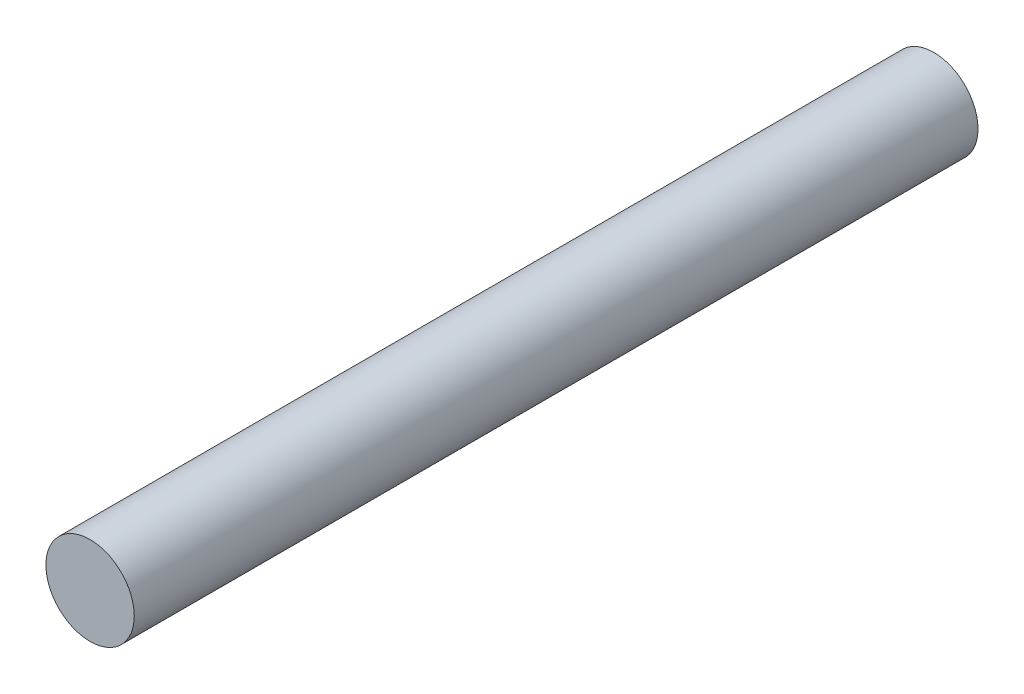
ISO-10303-21;
HEADER;
FILE_DESCRIPTION(('STEP AP214'),'2;1');
FILE_NAME('part.step','',(''),(''),'','','');
FILE_SCHEMA(('AUTOMOTIVE_DESIGN { 1 0 10303 214 1 1 1 1 }'));
ENDSEC;
DATA;
#1=APPLICATION_CONTEXT('core data for automotive mechanical design processes');
#2=APPLICATION_PROTOCOL_DEFINITION('international standard','automotive_design',2000,#1);
#3=PRODUCT_CONTEXT('',#1,'mechanical');
#4=PRODUCT('Part','Part','',(#3));
#5=PRODUCT_RELATED_PRODUCT_CATEGORY('part','',(#4));
#6=PRODUCT_DEFINITION_FORMATION('','',#4);
#7=PRODUCT_DEFINITION_CONTEXT('part definition',#1,'design');
#8=PRODUCT_DEFINITION('design','',#6,#7);
#9=PRODUCT_DEFINITION_SHAPE('','',#8);
#10=(LENGTH_UNIT() NAMED_UNIT(*) SI_UNIT(.MILLI.,.METRE.));
#11=(NAMED_UNIT(*) PLANE_ANGLE_UNIT() SI_UNIT($,.RADIAN.));
#12=(NAMED_UNIT(*) SI_UNIT($,.STERADIAN.) SOLID_ANGLE_UNIT());
#13=UNCERTAINTY_MEASURE_WITH_UNIT(LENGTH_MEASURE(1.E-05),#10,'distance_accuracy_value','');
#14=(GEOMETRIC_REPRESENTATION_CONTEXT(3) GLOBAL_UNCERTAINTY_ASSIGNED_CONTEXT((#13)) GLOBAL_UNIT_ASSIGNED_CONTEXT((#10,
#11,#12)) REPRESENTATION_CONTEXT('',''));
#15=CARTESIAN_POINT('',(0.,0.,0.));
#16=DIRECTION('',(0.,0.,1.));
#17=DIRECTION('',(1.,0.,0.));
#18=AXIS2_PLACEMENT_3D('',#15,#16,#17);
#19=CARTESIAN_POINT('',(0.,0.,24.257));
#20=DIRECTION('',(0.,0.,-1.));
#21=DIRECTION('',(-1.,0.,0.));
#22=AXIS2_PLACEMENT_3D('',#19,#20,#21);
#23=CYLINDRICAL_SURFACE('',#22,1.27);
#24=CARTESIAN_POINT('',(0.,0.,24.257));
#25=DIRECTION('',(0.,0.,1.));
#26=DIRECTION('',(1.,0.,0.));
#27=AXIS2_PLACEMENT_3D('',#24,#25,#26);
#28=CIRCLE('',#27,1.27);
#29=CARTESIAN_POINT('',(1.27,0.,24.257));
#30=VERTEX_POINT('',#29);
#31=EDGE_CURVE('E10',#30,#30,#28,.T.);
#32=ORIENTED_EDGE('',*,*,#31,.F.);
#33=EDGE_LOOP('',(#32));
#34=FACE_BOUND('',#33,.T.);
#35=CARTESIAN_POINT('',(0.,0.,0.));
#36=DIRECTION('',(0.,0.,1.));
#37=DIRECTION('',(1.,0.,0.));
#38=AXIS2_PLACEMENT_3D('',#35,#36,#37);
#39=CIRCLE('',#38,1.27);
#40=CARTESIAN_POINT('',(1.27,0.,0.));
#41=VERTEX_POINT('',#40);
#42=EDGE_CURVE('E36',#41,#41,#39,.T.);
#43=ORIENTED_EDGE('',*,*,#42,.T.);
#44=EDGE_LOOP('',(#43));
#45=FACE_BOUND('',#44,.T.);
#46=ADVANCED_FACE('F33',(#34,#45),#23,.T.);
#47=CARTESIAN_POINT('',(0.,0.,24.257));
#48=DIRECTION('',(0.,0.,1.));
#49=DIRECTION('',(1.,0.,0.));
#50=AXIS2_PLACEMENT_3D('',#47,#48,#49);
#51=PLANE('',#50);
#52=ORIENTED_EDGE('',*,*,#31,.T.);
#53=EDGE_LOOP('',(#52));
#54=FACE_BOUND('',#53,.T.);
#55=ADVANCED_FACE('F48',(#54),#51,.T.);
#56=CARTESIAN_POINT('',(0.,0.,0.));
#57=DIRECTION('',(0.,0.,1.));
#58=DIRECTION('',(1.,0.,0.));
#59=AXIS2_PLACEMENT_3D('',#56,#57,#58);
#60=PLANE('',#59);
#61=ORIENTED_EDGE('',*,*,#42,.F.);
#62=EDGE_LOOP('',(#61));
#63=FACE_BOUND('',#62,.T.);
#64=ADVANCED_FACE('F46',(#63),#60,.F.);
#65=CLOSED_SHELL('',(#46,#55,#64));
#66=MANIFOLD_SOLID_BREP('B2',#65);
#67=ADVANCED_BREP_SHAPE_REPRESENTATION('',(#18,#66),#14);
#68=SHAPE_DEFINITION_REPRESENTATION(#9,#67);
ENDSEC;
END-ISO-10303-21;
